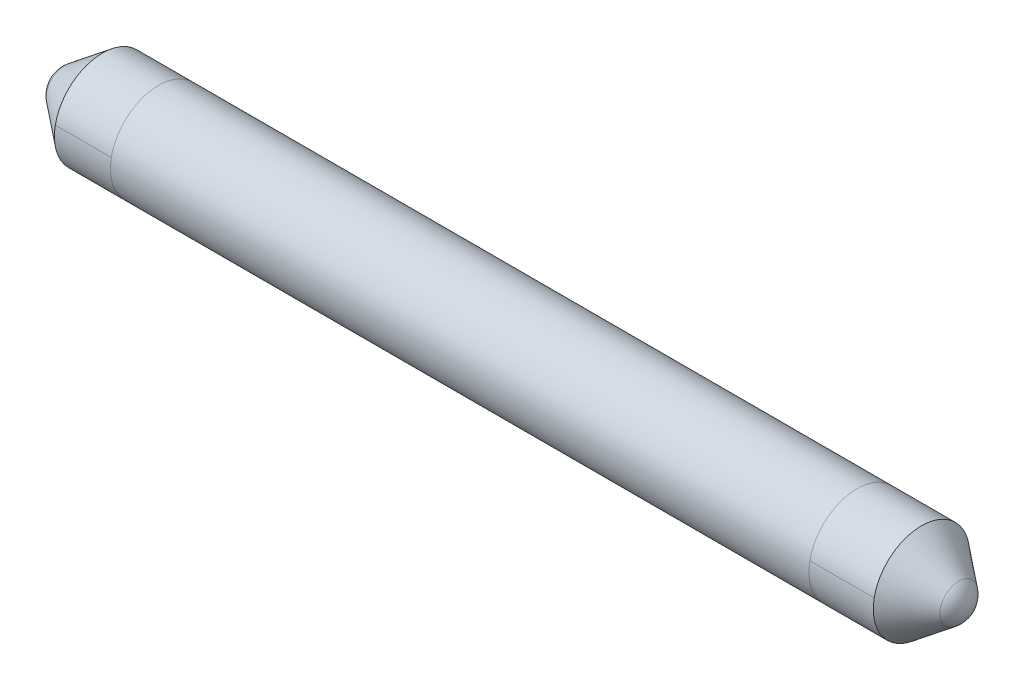
ISO-10303-21;
HEADER;
FILE_DESCRIPTION(('STEP AP214'),'2;1');
FILE_NAME('part.step','',(''),(''),'','','');
FILE_SCHEMA(('AUTOMOTIVE_DESIGN { 1 0 10303 214 1 1 1 1 }'));
ENDSEC;
DATA;
#1=APPLICATION_CONTEXT('core data for automotive mechanical design processes');
#2=APPLICATION_PROTOCOL_DEFINITION('international standard','automotive_design',2000,#1);
#3=PRODUCT_CONTEXT('',#1,'mechanical');
#4=PRODUCT('Part','Part','',(#3));
#5=PRODUCT_RELATED_PRODUCT_CATEGORY('part','',(#4));
#6=PRODUCT_DEFINITION_FORMATION('','',#4);
#7=PRODUCT_DEFINITION_CONTEXT('part definition',#1,'design');
#8=PRODUCT_DEFINITION('design','',#6,#7);
#9=PRODUCT_DEFINITION_SHAPE('','',#8);
#10=(LENGTH_UNIT() NAMED_UNIT(*) SI_UNIT(.MILLI.,.METRE.));
#11=(NAMED_UNIT(*) PLANE_ANGLE_UNIT() SI_UNIT($,.RADIAN.));
#12=(NAMED_UNIT(*) SI_UNIT($,.STERADIAN.) SOLID_ANGLE_UNIT());
#13=UNCERTAINTY_MEASURE_WITH_UNIT(LENGTH_MEASURE(1.E-05),#10,'distance_accuracy_value','');
#14=(GEOMETRIC_REPRESENTATION_CONTEXT(3) GLOBAL_UNCERTAINTY_ASSIGNED_CONTEXT((#13)) GLOBAL_UNIT_ASSIGNED_CONTEXT((#10,
#11,#12)) REPRESENTATION_CONTEXT('',''));
#15=CARTESIAN_POINT('',(0.,0.,0.));
#16=DIRECTION('',(0.,0.,1.));
#17=DIRECTION('',(1.,0.,0.));
#18=AXIS2_PLACEMENT_3D('',#15,#16,#17);
#19=CARTESIAN_POINT('',(0.,-101.643982592585,0.));
#20=DIRECTION('',(1.,0.,0.));
#21=DIRECTION('',(0.,1.,0.));
#22=AXIS2_PLACEMENT_3D('',#19,#20,#21);
#23=CYLINDRICAL_SURFACE('',#22,20.);
#24=DIRECTION('',(1.,0.,0.));
#25=VECTOR('',#24,1.);
#26=CARTESIAN_POINT('',(0.,-97.7702300396099,-19.6212650244147));
#27=LINE('',#26,#25);
#28=CARTESIAN_POINT('',(-170.,-97.7702300396099,-19.6212650244147));
#29=VERTEX_POINT('',#28);
#30=CARTESIAN_POINT('',(-146.749372236452,-97.7702300396099,-19.6212650244147));
#31=VERTEX_POINT('',#30);
#32=EDGE_CURVE('E11',#29,#31,#27,.T.);
#33=ORIENTED_EDGE('',*,*,#32,.F.);
#34=CARTESIAN_POINT('',(-170.,-101.643982592585,0.));
#35=DIRECTION('',(1.,0.,0.));
#36=DIRECTION('',(0.,1.,0.));
#37=AXIS2_PLACEMENT_3D('',#34,#35,#36);
#38=CIRCLE('',#37,20.);
#39=CARTESIAN_POINT('',(-170.,-97.7702300396099,19.6212650244147));
#40=VERTEX_POINT('',#39);
#41=EDGE_CURVE('E137',#29,#40,#38,.T.);
#42=ORIENTED_EDGE('',*,*,#41,.T.);
#43=DIRECTION('',(1.,0.,0.));
#44=VECTOR('',#43,1.);
#45=CARTESIAN_POINT('',(0.,-97.7702300396099,19.6212650244147));
#46=LINE('',#45,#44);
#47=CARTESIAN_POINT('',(-146.749372236452,-97.7702300396099,19.6212650244147));
#48=VERTEX_POINT('',#47);
#49=EDGE_CURVE('E56',#48,#40,#46,.F.);
#50=ORIENTED_EDGE('',*,*,#49,.F.);
#51=CARTESIAN_POINT('',(-146.749372236452,-101.643982592585,0.));
#52=DIRECTION('',(-1.,0.,0.));
#53=DIRECTION('',(0.,0.,1.));
#54=AXIS2_PLACEMENT_3D('',#51,#52,#53);
#55=CIRCLE('',#54,20.);
#56=EDGE_CURVE('E104',#48,#31,#55,.T.);
#57=ORIENTED_EDGE('',*,*,#56,.T.);
#58=EDGE_LOOP('',(#33,#42,#50,#57));
#59=FACE_BOUND('',#58,.T.);
#60=ADVANCED_FACE('F46',(#59),#23,.T.);
#61=DIRECTION('',(1.,0.,0.));
#62=VECTOR('',#61,1.);
#63=CARTESIAN_POINT('',(0.,-97.7702300396099,-19.6212650244147));
#64=LINE('',#63,#62);
#65=CARTESIAN_POINT('',(143.284700236208,-97.7702300396099,-19.6212650244147));
#66=VERTEX_POINT('',#65);
#67=CARTESIAN_POINT('',(170.,-97.7702300396099,-19.6212650244147));
#68=VERTEX_POINT('',#67);
#69=EDGE_CURVE('E88',#66,#68,#64,.T.);
#70=ORIENTED_EDGE('',*,*,#69,.F.);
#71=CARTESIAN_POINT('',(143.284700236208,-101.643982592585,0.));
#72=DIRECTION('',(1.,0.,0.));
#73=DIRECTION('',(0.,0.,-1.));
#74=AXIS2_PLACEMENT_3D('',#71,#72,#73);
#75=CIRCLE('',#74,20.);
#76=CARTESIAN_POINT('',(143.284700236208,-97.7702300396099,19.6212650244147));
#77=VERTEX_POINT('',#76);
#78=EDGE_CURVE('E92',#66,#77,#75,.T.);
#79=ORIENTED_EDGE('',*,*,#78,.T.);
#80=DIRECTION('',(1.,0.,0.));
#81=VECTOR('',#80,1.);
#82=CARTESIAN_POINT('',(0.,-97.7702300396099,19.6212650244147));
#83=LINE('',#82,#81);
#84=CARTESIAN_POINT('',(170.,-97.7702300396099,19.6212650244147));
#85=VERTEX_POINT('',#84);
#86=EDGE_CURVE('E50',#85,#77,#83,.F.);
#87=ORIENTED_EDGE('',*,*,#86,.F.);
#88=CARTESIAN_POINT('',(170.,-101.643982592585,0.));
#89=DIRECTION('',(1.,0.,0.));
#90=DIRECTION('',(0.,1.,0.));
#91=AXIS2_PLACEMENT_3D('',#88,#89,#90);
#92=CIRCLE('',#91,20.);
#93=EDGE_CURVE('E94',#68,#85,#92,.T.);
#94=ORIENTED_EDGE('',*,*,#93,.F.);
#95=EDGE_LOOP('',(#70,#79,#87,#94));
#96=FACE_BOUND('',#95,.T.);
#97=ADVANCED_FACE('F90',(#96),#23,.T.);
#98=ORIENTED_EDGE('',*,*,#56,.F.);
#99=EDGE_CURVE('E125',#31,#48,#55,.T.);
#100=ORIENTED_EDGE('',*,*,#99,.F.);
#101=EDGE_LOOP('',(#98,#100));
#102=FACE_BOUND('',#101,.T.);
#103=ORIENTED_EDGE('',*,*,#78,.F.);
#104=EDGE_CURVE('E100',#77,#66,#75,.T.);
#105=ORIENTED_EDGE('',*,*,#104,.F.);
#106=EDGE_LOOP('',(#103,#105));
#107=FACE_BOUND('',#106,.T.);
#108=ADVANCED_FACE('F106',(#102,#107),#23,.T.);
#109=ORIENTED_EDGE('',*,*,#104,.T.);
#110=ORIENTED_EDGE('',*,*,#69,.T.);
#111=EDGE_CURVE('E143',#85,#68,#92,.T.);
#112=ORIENTED_EDGE('',*,*,#111,.F.);
#113=ORIENTED_EDGE('',*,*,#86,.T.);
#114=EDGE_LOOP('',(#109,#110,#112,#113));
#115=FACE_BOUND('',#114,.T.);
#116=ADVANCED_FACE('F101',(#115),#23,.T.);
#117=CARTESIAN_POINT('',(-179.372661972358,-101.643982592585,0.));
#118=DIRECTION('',(1.,0.,0.));
#119=DIRECTION('',(0.,-1.,0.));
#120=AXIS2_PLACEMENT_3D('',#117,#118,#119);
#121=SPHERICAL_SURFACE('',#120,9.99999999999999);
#122=CARTESIAN_POINT('',(-185.525206376971,-101.643982592585,0.));
#123=DIRECTION('',(1.,0.,0.));
#124=DIRECTION('',(0.,1.,0.));
#125=AXIS2_PLACEMENT_3D('',#122,#123,#124);
#126=CIRCLE('',#125,7.88328594871819);
#127=CARTESIAN_POINT('',(-185.525206376971,-93.7606966438669,0.));
#128=VERTEX_POINT('',#127);
#129=EDGE_CURVE('E128',#128,#128,#126,.T.);
#130=ORIENTED_EDGE('',*,*,#129,.F.);
#131=EDGE_LOOP('',(#130));
#132=FACE_BOUND('',#131,.T.);
#133=ADVANCED_FACE('F48',(#132),#121,.T.);
#134=CARTESIAN_POINT('',(-170.,-101.643982592585,0.));
#135=DIRECTION('',(1.,0.,0.));
#136=DIRECTION('',(0.,1.,0.));
#137=AXIS2_PLACEMENT_3D('',#134,#135,#136);
#138=CONICAL_SURFACE('',#137,20.,0.662708685262541);
#139=ORIENTED_EDGE('',*,*,#129,.T.);
#140=EDGE_LOOP('',(#139));
#141=FACE_BOUND('',#140,.T.);
#142=EDGE_CURVE('E134',#40,#29,#38,.T.);
#143=ORIENTED_EDGE('',*,*,#142,.F.);
#144=ORIENTED_EDGE('',*,*,#41,.F.);
#145=EDGE_LOOP('',(#143,#144));
#146=FACE_BOUND('',#145,.T.);
#147=ADVANCED_FACE('F163',(#141,#146),#138,.T.);
#148=ORIENTED_EDGE('',*,*,#142,.T.);
#149=ORIENTED_EDGE('',*,*,#32,.T.);
#150=ORIENTED_EDGE('',*,*,#99,.T.);
#151=ORIENTED_EDGE('',*,*,#49,.T.);
#152=EDGE_LOOP('',(#148,#149,#150,#151));
#153=FACE_BOUND('',#152,.T.);
#154=ADVANCED_FACE('F153',(#153),#23,.T.);
#155=CARTESIAN_POINT('',(179.372661972358,-101.643982592585,0.));
#156=DIRECTION('',(-1.,0.,0.));
#157=DIRECTION('',(0.,-1.,0.));
#158=AXIS2_PLACEMENT_3D('',#155,#156,#157);
#159=SPHERICAL_SURFACE('',#158,9.99999999999999);
#160=CARTESIAN_POINT('',(185.525206376971,-101.643982592585,0.));
#161=DIRECTION('',(1.,0.,0.));
#162=DIRECTION('',(0.,1.,0.));
#163=AXIS2_PLACEMENT_3D('',#160,#161,#162);
#164=CIRCLE('',#163,7.88328594871819);
#165=CARTESIAN_POINT('',(185.525206376971,-93.7606966438669,0.));
#166=VERTEX_POINT('',#165);
#167=EDGE_CURVE('E140',#166,#166,#164,.T.);
#168=ORIENTED_EDGE('',*,*,#167,.T.);
#169=EDGE_LOOP('',(#168));
#170=FACE_BOUND('',#169,.T.);
#171=ADVANCED_FACE('F147',(#170),#159,.T.);
#172=CARTESIAN_POINT('',(170.,-101.643982592585,0.));
#173=DIRECTION('',(-1.,0.,0.));
#174=DIRECTION('',(0.,1.,0.));
#175=AXIS2_PLACEMENT_3D('',#172,#173,#174);
#176=CONICAL_SURFACE('',#175,20.,0.662708685262541);
#177=ORIENTED_EDGE('',*,*,#167,.F.);
#178=EDGE_LOOP('',(#177));
#179=FACE_BOUND('',#178,.T.);
#180=ORIENTED_EDGE('',*,*,#111,.T.);
#181=ORIENTED_EDGE('',*,*,#93,.T.);
#182=EDGE_LOOP('',(#180,#181));
#183=FACE_BOUND('',#182,.T.);
#184=ADVANCED_FACE('F145',(#179,#183),#176,.T.);
#185=CLOSED_SHELL('',(#60,#97,#108,#116,#133,#147,#154,#171,#184));
#186=MANIFOLD_SOLID_BREP('B2',#185);
#187=ADVANCED_BREP_SHAPE_REPRESENTATION('',(#18,#186),#14);
#188=SHAPE_DEFINITION_REPRESENTATION(#9,#187);
ENDSEC;
END-ISO-10303-21;
